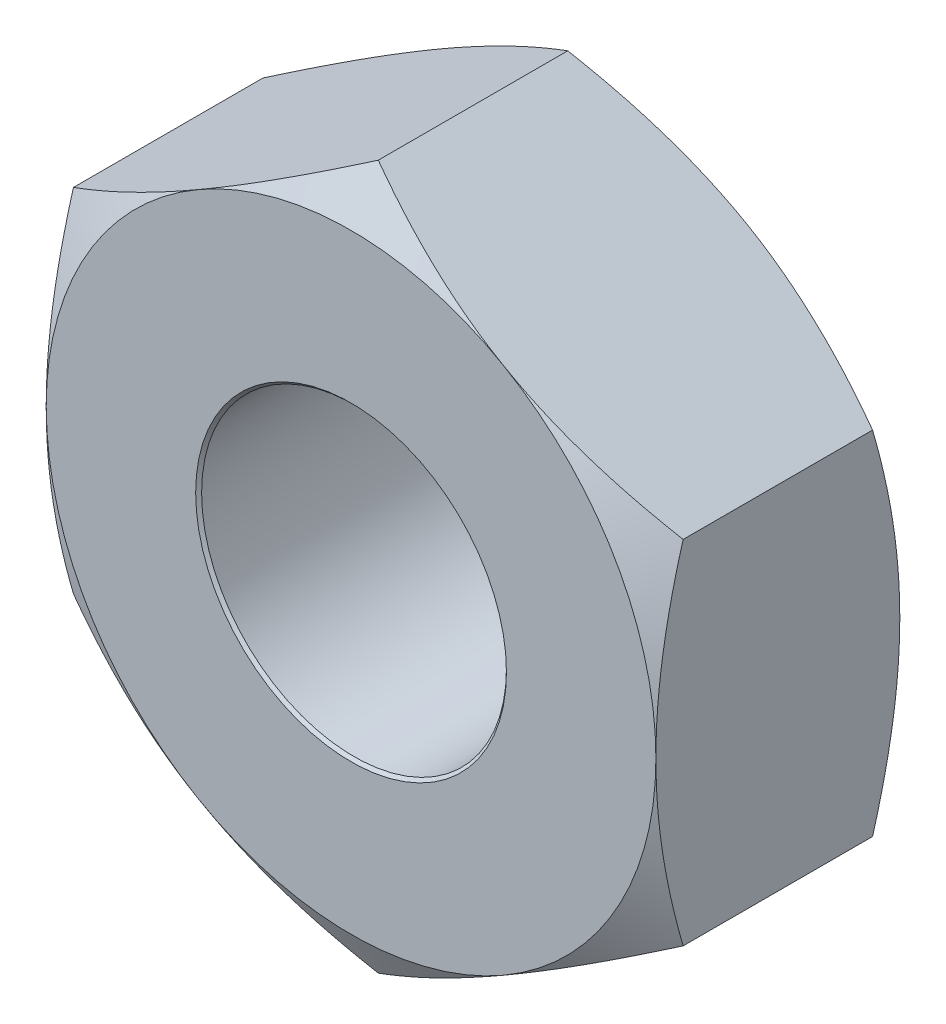
ISO-10303-21;
HEADER;
FILE_DESCRIPTION(('STEP AP214'),'2;1');
FILE_NAME('part.step','',(''),(''),'','','');
FILE_SCHEMA(('AUTOMOTIVE_DESIGN { 1 0 10303 214 1 1 1 1 }'));
ENDSEC;
DATA;
#1=APPLICATION_CONTEXT('core data for automotive mechanical design processes');
#2=APPLICATION_PROTOCOL_DEFINITION('international standard','automotive_design',2000,#1);
#3=PRODUCT_CONTEXT('',#1,'mechanical');
#4=PRODUCT('Part','Part','',(#3));
#5=PRODUCT_RELATED_PRODUCT_CATEGORY('part','',(#4));
#6=PRODUCT_DEFINITION_FORMATION('','',#4);
#7=PRODUCT_DEFINITION_CONTEXT('part definition',#1,'design');
#8=PRODUCT_DEFINITION('design','',#6,#7);
#9=PRODUCT_DEFINITION_SHAPE('','',#8);
#10=(LENGTH_UNIT() NAMED_UNIT(*) SI_UNIT(.MILLI.,.METRE.));
#11=(NAMED_UNIT(*) PLANE_ANGLE_UNIT() SI_UNIT($,.RADIAN.));
#12=(NAMED_UNIT(*) SI_UNIT($,.STERADIAN.) SOLID_ANGLE_UNIT());
#13=UNCERTAINTY_MEASURE_WITH_UNIT(LENGTH_MEASURE(1.E-05),#10,'distance_accuracy_value','');
#14=(GEOMETRIC_REPRESENTATION_CONTEXT(3) GLOBAL_UNCERTAINTY_ASSIGNED_CONTEXT((#13)) GLOBAL_UNIT_ASSIGNED_CONTEXT((#10,
#11,#12)) REPRESENTATION_CONTEXT('',''));
#15=CARTESIAN_POINT('',(0.,0.,0.));
#16=DIRECTION('',(0.,0.,1.));
#17=DIRECTION('',(1.,0.,0.));
#18=AXIS2_PLACEMENT_3D('',#15,#16,#17);
#19=CARTESIAN_POINT('',(0.,0.,-1.));
#20=DIRECTION('',(0.,0.,-1.));
#21=DIRECTION('',(-1.,0.,0.));
#22=AXIS2_PLACEMENT_3D('',#19,#20,#21);
#23=CONICAL_SURFACE('',#22,1.27435696448144,0.78539816339745);
#24=CARTESIAN_POINT('',(0.,0.,-0.975643035518566));
#25=DIRECTION('',(0.,0.,1.));
#26=DIRECTION('',(-1.,0.,0.));
#27=AXIS2_PLACEMENT_3D('',#24,#25,#26);
#28=CIRCLE('',#27,1.25);
#29=CARTESIAN_POINT('',(-1.25,0.,-0.975643035518566));
#30=VERTEX_POINT('',#29);
#31=EDGE_CURVE('E11',#30,#30,#28,.T.);
#32=ORIENTED_EDGE('',*,*,#31,.T.);
#33=EDGE_LOOP('',(#32));
#34=FACE_BOUND('',#33,.T.);
#35=CARTESIAN_POINT('',(0.,0.,-1.));
#36=DIRECTION('',(0.,0.,-1.));
#37=DIRECTION('',(-1.,0.,0.));
#38=AXIS2_PLACEMENT_3D('',#35,#36,#37);
#39=CIRCLE('',#38,1.27435696448144);
#40=CARTESIAN_POINT('',(-1.27435696448144,0.,-1.));
#41=VERTEX_POINT('',#40);
#42=EDGE_CURVE('E299',#41,#41,#39,.T.);
#43=ORIENTED_EDGE('',*,*,#42,.T.);
#44=EDGE_LOOP('',(#43));
#45=FACE_BOUND('',#44,.T.);
#46=ADVANCED_FACE('F16',(#34,#45),#23,.F.);
#47=CARTESIAN_POINT('',(0.,0.,1.));
#48=DIRECTION('',(0.,0.,1.));
#49=DIRECTION('',(1.,0.,0.));
#50=AXIS2_PLACEMENT_3D('',#47,#48,#49);
#51=CONICAL_SURFACE('',#50,1.27435696448144,0.78539816339745);
#52=CARTESIAN_POINT('',(0.,0.,0.975643035518566));
#53=DIRECTION('',(0.,0.,-1.));
#54=DIRECTION('',(1.,0.,0.));
#55=AXIS2_PLACEMENT_3D('',#52,#53,#54);
#56=CIRCLE('',#55,1.25);
#57=CARTESIAN_POINT('',(1.25,0.,0.975643035518566));
#58=VERTEX_POINT('',#57);
#59=EDGE_CURVE('E30',#58,#58,#56,.T.);
#60=ORIENTED_EDGE('',*,*,#59,.T.);
#61=EDGE_LOOP('',(#60));
#62=FACE_BOUND('',#61,.T.);
#63=CARTESIAN_POINT('',(0.,0.,1.));
#64=DIRECTION('',(0.,0.,1.));
#65=DIRECTION('',(1.,0.,0.));
#66=AXIS2_PLACEMENT_3D('',#63,#64,#65);
#67=CIRCLE('',#66,1.27435696448144);
#68=CARTESIAN_POINT('',(1.27435696448144,0.,1.));
#69=VERTEX_POINT('',#68);
#70=EDGE_CURVE('E999',#69,#69,#67,.T.);
#71=ORIENTED_EDGE('',*,*,#70,.T.);
#72=EDGE_LOOP('',(#71));
#73=FACE_BOUND('',#72,.T.);
#74=ADVANCED_FACE('F415',(#62,#73),#51,.F.);
#75=CARTESIAN_POINT('',(0.,0.,-1.));
#76=DIRECTION('',(0.,0.,1.));
#77=DIRECTION('',(1.,0.,0.));
#78=AXIS2_PLACEMENT_3D('',#75,#76,#77);
#79=CONICAL_SURFACE('',#78,2.5,1.0471975511966);
#80=CARTESIAN_POINT('',(0.,0.,-1.));
#81=DIRECTION('',(0.,0.,-1.));
#82=DIRECTION('',(1.,0.,0.));
#83=AXIS2_PLACEMENT_3D('',#80,#81,#82);
#84=CIRCLE('',#83,2.5);
#85=CARTESIAN_POINT('',(2.5,0.,-1.));
#86=VERTEX_POINT('',#85);
#87=CARTESIAN_POINT('',(1.25,-2.1650635094611,-1.));
#88=VERTEX_POINT('',#87);
#89=EDGE_CURVE('E530',#86,#88,#84,.T.);
#90=ORIENTED_EDGE('',*,*,#89,.F.);
#91=CARTESIAN_POINT('',(2.5,-1.44337567297418,-0.77670900630749));
#92=CARTESIAN_POINT('',(2.5,-1.06719090824318,-0.885304193898555));
#93=CARTESIAN_POINT('',(2.5,-0.727333879858001,-0.940155288511735));
#94=CARTESIAN_POINT('',(2.5,-0.356536433528046,-1.));
#95=CARTESIAN_POINT('',(2.5,0.,-1.));
#96=B_SPLINE_CURVE_WITH_KNOTS('',2,(#91,#92,#93,#94,#95),.UNSPECIFIED.,.F.,.F.,(3,2,3),(0.,0.5,
1.),.UNSPECIFIED.);
#97=CARTESIAN_POINT('',(2.5,-1.44337567297418,-0.77670900630749));
#98=VERTEX_POINT('',#97);
#99=EDGE_CURVE('E1068',#98,#86,#96,.T.);
#100=ORIENTED_EDGE('',*,*,#99,.F.);
#101=CARTESIAN_POINT('',(1.25,-2.16506350946109,-1.));
#102=CARTESIAN_POINT('',(1.55941196430674,-1.9864244285781,-1.));
#103=CARTESIAN_POINT('',(1.88220606748083,-1.80005916621771,-0.939723155230925));
#104=CARTESIAN_POINT('',(2.17495878359943,-1.63103830676065,-0.885056078442075));
#105=CARTESIAN_POINT('',(2.49999999999994,-1.44337567297409,-0.77670900630749));
#106=B_SPLINE_CURVE_WITH_KNOTS('',2,(#101,#102,#103,#104,#105),.UNSPECIFIED.,.F.,.F.,(3,2,3),
(0.,0.5,1.),.UNSPECIFIED.);
#107=EDGE_CURVE('E147',#88,#98,#106,.T.);
#108=ORIENTED_EDGE('',*,*,#107,.F.);
#109=EDGE_LOOP('',(#90,#100,#108));
#110=FACE_BOUND('',#109,.T.);
#111=ADVANCED_FACE('F568',(#110),#79,.T.);
#112=CARTESIAN_POINT('',(0.,0.,-1.));
#113=DIRECTION('',(0.,0.,1.));
#114=DIRECTION('',(1.,0.,0.));
#115=AXIS2_PLACEMENT_3D('',#112,#113,#114);
#116=CONICAL_SURFACE('',#115,2.5,1.0471975511966);
#117=CARTESIAN_POINT('',(0.,0.,-1.));
#118=DIRECTION('',(0.,0.,-1.));
#119=DIRECTION('',(1.,0.,0.));
#120=AXIS2_PLACEMENT_3D('',#117,#118,#119);
#121=CIRCLE('',#120,2.5);
#122=CARTESIAN_POINT('',(-1.25,-2.1650635094611,-1.));
#123=VERTEX_POINT('',#122);
#124=EDGE_CURVE('E141',#88,#123,#121,.T.);
#125=ORIENTED_EDGE('',*,*,#124,.F.);
#126=CARTESIAN_POINT('',(0.,-2.88675134594812,-0.77670900630741));
#127=CARTESIAN_POINT('',(0.669872981070598,-2.50000000000415,-1.));
#128=CARTESIAN_POINT('',(1.25,-2.16506350946109,-1.));
#129=B_SPLINE_CURVE_WITH_KNOTS('',2,(#126,#127,#128),.UNSPECIFIED.,.F.,.F.,(3,3),(0.,1.),.UNSPECIFIED.);
#130=CARTESIAN_POINT('',(0.,-2.88675134594812,-0.776709006307409));
#131=VERTEX_POINT('',#130);
#132=EDGE_CURVE('E133',#131,#88,#129,.T.);
#133=ORIENTED_EDGE('',*,*,#132,.F.);
#134=CARTESIAN_POINT('',(-1.24999999999999,-2.16506350946109,-1.));
#135=CARTESIAN_POINT('',(-0.940588035692977,-2.34370259034423,-1.));
#136=CARTESIAN_POINT('',(-0.617793932519125,-2.53006785270448,-0.93972315523092));
#137=CARTESIAN_POINT('',(-0.325041216399958,-2.69908871216188,-0.88505607844192));
#138=CARTESIAN_POINT('',(0.,-2.88675134594812,-0.77670900630741));
#139=B_SPLINE_CURVE_WITH_KNOTS('',2,(#134,#135,#136,#137,#138),.UNSPECIFIED.,.F.,.F.,(3,2,3),
(0.,0.5,1.),.UNSPECIFIED.);
#140=EDGE_CURVE('E137',#123,#131,#139,.T.);
#141=ORIENTED_EDGE('',*,*,#140,.F.);
#142=EDGE_LOOP('',(#125,#133,#141));
#143=FACE_BOUND('',#142,.T.);
#144=ADVANCED_FACE('F18',(#143),#116,.T.);
#145=CARTESIAN_POINT('',(0.,0.,-1.));
#146=DIRECTION('',(0.,0.,1.));
#147=DIRECTION('',(1.,0.,0.));
#148=AXIS2_PLACEMENT_3D('',#145,#146,#147);
#149=CONICAL_SURFACE('',#148,2.5,1.0471975511966);
#150=CARTESIAN_POINT('',(0.,0.,-1.));
#151=DIRECTION('',(0.,0.,-1.));
#152=DIRECTION('',(1.,0.,0.));
#153=AXIS2_PLACEMENT_3D('',#150,#151,#152);
#154=CIRCLE('',#153,2.5);
#155=CARTESIAN_POINT('',(-2.5,0.,-1.));
#156=VERTEX_POINT('',#155);
#157=EDGE_CURVE('E243',#123,#156,#154,.T.);
#158=ORIENTED_EDGE('',*,*,#157,.F.);
#159=CARTESIAN_POINT('',(-2.5,-1.44337567297405,-0.776709006307405));
#160=CARTESIAN_POINT('',(-1.8301270189294,-1.83012701891802,-1.));
#161=CARTESIAN_POINT('',(-1.24999999999999,-2.16506350946109,-1.));
#162=B_SPLINE_CURVE_WITH_KNOTS('',2,(#159,#160,#161),.UNSPECIFIED.,.F.,.F.,(3,3),(0.,1.),.UNSPECIFIED.);
#163=CARTESIAN_POINT('',(-2.5,-1.44337567297405,-0.776709006307406));
#164=VERTEX_POINT('',#163);
#165=EDGE_CURVE('E163',#164,#123,#162,.T.);
#166=ORIENTED_EDGE('',*,*,#165,.F.);
#167=CARTESIAN_POINT('',(-2.5,0.,-1.));
#168=CARTESIAN_POINT('',(-2.5,-0.356024272855809,-1.));
#169=CARTESIAN_POINT('',(-2.5,-0.727333879865234,-0.940155288510565));
#170=CARTESIAN_POINT('',(-2.5,-1.06659752609985,-0.88547548856871));
#171=CARTESIAN_POINT('',(-2.5,-1.44337567297405,-0.776709006307405));
#172=B_SPLINE_CURVE_WITH_KNOTS('',2,(#167,#168,#169,#170,#171),.UNSPECIFIED.,.F.,.F.,(3,2,3),
(0.,0.5,1.),.UNSPECIFIED.);
#173=EDGE_CURVE('E467',#156,#164,#172,.T.);
#174=ORIENTED_EDGE('',*,*,#173,.F.);
#175=EDGE_LOOP('',(#158,#166,#174));
#176=FACE_BOUND('',#175,.T.);
#177=ADVANCED_FACE('F211',(#176),#149,.T.);
#178=CARTESIAN_POINT('',(0.,0.,-1.));
#179=DIRECTION('',(0.,0.,1.));
#180=DIRECTION('',(1.,0.,0.));
#181=AXIS2_PLACEMENT_3D('',#178,#179,#180);
#182=CONICAL_SURFACE('',#181,2.5,1.0471975511966);
#183=CARTESIAN_POINT('',(0.,0.,-1.));
#184=DIRECTION('',(0.,0.,-1.));
#185=DIRECTION('',(1.,0.,0.));
#186=AXIS2_PLACEMENT_3D('',#183,#184,#185);
#187=CIRCLE('',#186,2.5);
#188=CARTESIAN_POINT('',(-1.25,2.1650635094611,-1.));
#189=VERTEX_POINT('',#188);
#190=EDGE_CURVE('E233',#156,#189,#187,.T.);
#191=ORIENTED_EDGE('',*,*,#190,.F.);
#192=CARTESIAN_POINT('',(-2.5,1.44337567297407,-0.7767090063074));
#193=CARTESIAN_POINT('',(-2.5,1.07011411791631,-0.884460335952765));
#194=CARTESIAN_POINT('',(-2.5,0.732711473700883,-0.939285017052365));
#195=CARTESIAN_POINT('',(-2.5,0.35905867027078,-1.));
#196=CARTESIAN_POINT('',(-2.5,0.,-1.));
#197=B_SPLINE_CURVE_WITH_KNOTS('',2,(#192,#193,#194,#195,#196),.UNSPECIFIED.,.F.,.F.,(3,2,3),
(0.,0.5,1.),.UNSPECIFIED.);
#198=CARTESIAN_POINT('',(-2.5,1.44337567297407,-0.776709006307401));
#199=VERTEX_POINT('',#198);
#200=EDGE_CURVE('E251',#199,#156,#197,.T.);
#201=ORIENTED_EDGE('',*,*,#200,.F.);
#202=CARTESIAN_POINT('',(-1.25,2.1650635094611,-1.));
#203=CARTESIAN_POINT('',(-1.55941196430711,1.9864244285779,-1.));
#204=CARTESIAN_POINT('',(-1.88220606748087,1.8000591662177,-0.93972315523091));
#205=CARTESIAN_POINT('',(-2.1749587836002,1.63103830676022,-0.88505607844186));
#206=CARTESIAN_POINT('',(-2.5,1.44337567297406,-0.7767090063074));
#207=B_SPLINE_CURVE_WITH_KNOTS('',2,(#202,#203,#204,#205,#206),.UNSPECIFIED.,.F.,.F.,(3,2,3),
(0.,0.5,1.),.UNSPECIFIED.);
#208=EDGE_CURVE('E346',#189,#199,#207,.T.);
#209=ORIENTED_EDGE('',*,*,#208,.F.);
#210=EDGE_LOOP('',(#191,#201,#209));
#211=FACE_BOUND('',#210,.T.);
#212=ADVANCED_FACE('F220',(#211),#182,.T.);
#213=CARTESIAN_POINT('',(0.,0.,-1.));
#214=DIRECTION('',(0.,0.,1.));
#215=DIRECTION('',(1.,0.,0.));
#216=AXIS2_PLACEMENT_3D('',#213,#214,#215);
#217=CONICAL_SURFACE('',#216,2.5,1.0471975511966);
#218=CARTESIAN_POINT('',(0.,0.,-1.));
#219=DIRECTION('',(0.,0.,-1.));
#220=DIRECTION('',(1.,0.,0.));
#221=AXIS2_PLACEMENT_3D('',#218,#219,#220);
#222=CIRCLE('',#221,2.5);
#223=CARTESIAN_POINT('',(1.25,2.1650635094611,-1.));
#224=VERTEX_POINT('',#223);
#225=EDGE_CURVE('E242',#189,#224,#222,.T.);
#226=ORIENTED_EDGE('',*,*,#225,.F.);
#227=CARTESIAN_POINT('',(0.,2.88675134594813,-0.776709006307405));
#228=CARTESIAN_POINT('',(-0.669872981070619,2.50000000000415,-1.));
#229=CARTESIAN_POINT('',(-1.25,2.1650635094611,-1.));
#230=B_SPLINE_CURVE_WITH_KNOTS('',2,(#227,#228,#229),.UNSPECIFIED.,.F.,.F.,(3,3),(0.,1.),.UNSPECIFIED.);
#231=CARTESIAN_POINT('',(0.,2.88675134594813,-0.776709006307403));
#232=VERTEX_POINT('',#231);
#233=EDGE_CURVE('E307',#232,#189,#230,.T.);
#234=ORIENTED_EDGE('',*,*,#233,.F.);
#235=CARTESIAN_POINT('',(1.25000000000001,2.1650635094611,-1.));
#236=CARTESIAN_POINT('',(0.94058803569276,2.34370259034438,-1.));
#237=CARTESIAN_POINT('',(0.617793932519138,2.53006785270449,-0.939723155230916));
#238=CARTESIAN_POINT('',(0.325041216399677,2.69908871216206,-0.885056078441816));
#239=CARTESIAN_POINT('',(0.,2.88675134594813,-0.776709006307406));
#240=B_SPLINE_CURVE_WITH_KNOTS('',2,(#235,#236,#237,#238,#239),.UNSPECIFIED.,.F.,.F.,(3,2,3),
(0.,0.5,1.),.UNSPECIFIED.);
#241=EDGE_CURVE('E380',#224,#232,#240,.T.);
#242=ORIENTED_EDGE('',*,*,#241,.F.);
#243=EDGE_LOOP('',(#226,#234,#242));
#244=FACE_BOUND('',#243,.T.);
#245=ADVANCED_FACE('F278',(#244),#217,.T.);
#246=CARTESIAN_POINT('',(0.,0.,-1.));
#247=DIRECTION('',(0.,0.,1.));
#248=DIRECTION('',(1.,0.,0.));
#249=AXIS2_PLACEMENT_3D('',#246,#247,#248);
#250=CONICAL_SURFACE('',#249,2.5,1.0471975511966);
#251=CARTESIAN_POINT('',(2.5,0.,-1.));
#252=CARTESIAN_POINT('',(2.5,0.358546870905485,-1.));
#253=CARTESIAN_POINT('',(2.5,0.7327114736965,-0.939285017053085));
#254=CARTESIAN_POINT('',(2.5,1.06952086217606,-0.88463159413344));
#255=CARTESIAN_POINT('',(2.5,1.44337567297407,-0.776709006307405));
#256=B_SPLINE_CURVE_WITH_KNOTS('',2,(#251,#252,#253,#254,#255),.UNSPECIFIED.,.F.,.F.,(3,2,3),
(0.,0.5,1.),.UNSPECIFIED.);
#257=CARTESIAN_POINT('',(2.5,1.44337567297407,-0.776709006307406));
#258=VERTEX_POINT('',#257);
#259=EDGE_CURVE('E1061',#86,#258,#256,.T.);
#260=ORIENTED_EDGE('',*,*,#259,.F.);
#261=CARTESIAN_POINT('',(0.,0.,-1.));
#262=DIRECTION('',(0.,0.,1.));
#263=DIRECTION('',(1.,0.,0.));
#264=AXIS2_PLACEMENT_3D('',#261,#262,#263);
#265=CIRCLE('',#264,2.5);
#266=EDGE_CURVE('E1153',#86,#224,#265,.T.);
#267=ORIENTED_EDGE('',*,*,#266,.T.);
#268=CARTESIAN_POINT('',(2.5,1.44337567297407,-0.776709006307406));
#269=CARTESIAN_POINT('',(1.83012701892939,1.83012701891804,-1.));
#270=CARTESIAN_POINT('',(1.25000000000001,2.1650635094611,-1.));
#271=B_SPLINE_CURVE_WITH_KNOTS('',2,(#268,#269,#270),.UNSPECIFIED.,.F.,.F.,(3,3),(0.,1.),.UNSPECIFIED.);
#272=EDGE_CURVE('E386',#258,#224,#271,.T.);
#273=ORIENTED_EDGE('',*,*,#272,.F.);
#274=EDGE_LOOP('',(#260,#267,#273));
#275=FACE_BOUND('',#274,.T.);
#276=ADVANCED_FACE('F221',(#275),#250,.T.);
#277=CARTESIAN_POINT('',(0.,0.,1.));
#278=DIRECTION('',(0.,0.,-1.));
#279=DIRECTION('',(1.,0.,0.));
#280=AXIS2_PLACEMENT_3D('',#277,#278,#279);
#281=CONICAL_SURFACE('',#280,2.5,1.0471975511966);
#282=CARTESIAN_POINT('',(1.25,2.16506350946109,1.));
#283=CARTESIAN_POINT('',(1.1973376519546,2.19544629836629,1.00002122820986));
#284=CARTESIAN_POINT('',(1.14465957489277,2.22580101022077,0.998760283259273));
#285=CARTESIAN_POINT('',(1.03962673820466,2.28633569969667,0.993716017519844));
#286=CARTESIAN_POINT('',(0.987271564280388,2.31651586612056,0.989943604101614));
#287=CARTESIAN_POINT('',(0.882393725295349,2.37706942325835,0.979880656964627));
#288=CARTESIAN_POINT('',(0.829872714735595,2.40744257989733,0.973571586833744));
#289=CARTESIAN_POINT('',(0.724117736178538,2.46861013052463,0.958478691993865));
#290=CARTESIAN_POINT('',(0.670888544003406,2.49940192777648,0.949651261429461));
#291=CARTESIAN_POINT('',(0.567070334904166,2.55936434801829,0.930238402450601));
#292=CARTESIAN_POINT('',(0.516469566583389,2.58854596200256,0.919749083484684));
#293=CARTESIAN_POINT('',(0.41486174160398,2.64716833841249,0.896710117301689));
#294=CARTESIAN_POINT('',(0.363859612984646,2.6766066232036,0.884132504815016));
#295=CARTESIAN_POINT('',(0.261157143495956,2.73590825033239,0.856935985883545));
#296=CARTESIAN_POINT('',(0.209464418694783,2.76576765649997,0.842279984085456));
#297=CARTESIAN_POINT('',(0.105111835169821,2.8260457425153,0.810931835399662));
#298=CARTESIAN_POINT('',(0.0524616270728385,2.85645886405582,0.794196766289006));
#299=CARTESIAN_POINT('',(0.,2.88675134594812,0.776709006307402));
#300=B_SPLINE_CURVE_WITH_KNOTS('',3,(#282,#283,#284,#285,#286,#287,#288,#289,#290,#291,#292,
#293,#294,#295,#296,#297,#298,#299),.UNSPECIFIED.,.F.,.F.,(4,2,2,2,2,2,2,2,4),(0.,
0.182380465673236,0.363973971080128,0.546919300279387,0.73324766315141,0.911255273309138,
1.09187401631464,1.27625891558621,1.46542190491653),.UNSPECIFIED.);
#301=CARTESIAN_POINT('',(1.25,2.1650635094611,1.));
#302=VERTEX_POINT('',#301);
#303=CARTESIAN_POINT('',(0.,2.88675134594813,0.776709006307403));
#304=VERTEX_POINT('',#303);
#305=EDGE_CURVE('E361',#302,#304,#300,.T.);
#306=ORIENTED_EDGE('',*,*,#305,.T.);
#307=CARTESIAN_POINT('',(0.,2.88675134594812,0.776709006307402));
#308=CARTESIAN_POINT('',(-0.0524740065390064,2.85645134053524,0.794201244934283));
#309=CARTESIAN_POINT('',(-0.105142679085746,2.82603845794373,0.810935656931974));
#310=CARTESIAN_POINT('',(-0.209573059580187,2.76574880591582,0.842286699748274));
#311=CARTESIAN_POINT('',(-0.261325210029163,2.73587725039229,0.856945297800471));
#312=CARTESIAN_POINT('',(-0.364182073073287,2.67653197614907,0.884151280120466));
#313=CARTESIAN_POINT('',(-0.415279395484295,2.64706204661166,0.896734632676111));
#314=CARTESIAN_POINT('',(-0.517108668131017,2.58835112379386,0.919788819933049));
#315=CARTESIAN_POINT('',(-0.567835962023478,2.55911256527261,0.930286356016276));
#316=CARTESIAN_POINT('',(-0.671785938266525,2.49908335642767,0.949694731592277));
#317=CARTESIAN_POINT('',(-0.725019304628973,2.46828148986288,0.9585142902416));
#318=CARTESIAN_POINT('',(-0.830725782142667,2.40710866758423,0.973592651079762));
#319=CARTESIAN_POINT('',(-0.883194051830785,2.376740684492,0.979897045219432));
#320=CARTESIAN_POINT('',(-0.987916225456374,2.31622505838499,0.98995064799648));
#321=CARTESIAN_POINT('',(-1.04016827084862,2.28607768865202,0.993720716853189));
#322=CARTESIAN_POINT('',(-1.14494978577106,2.22564737040332,0.998760212757112));
#323=CARTESIAN_POINT('',(-1.19747959649394,2.19536430764369,1.00002115953468));
#324=CARTESIAN_POINT('',(-1.25,2.16506350946109,1.));
#325=B_SPLINE_CURVE_WITH_KNOTS('',3,(#307,#308,#309,#310,#311,#312,#313,#314,#315,#316,#317,
#318,#319,#320,#321,#322,#323,#324),.UNSPECIFIED.,.F.,.F.,(4,2,2,2,2,2,2,2,4),(0.,
0.189208252890503,0.373762448535054,0.554672953225491,0.733092527500666,0.919443639311701,
1.10224390970384,1.28352048549225,1.46540870180805),.UNSPECIFIED.);
#326=CARTESIAN_POINT('',(-1.25,2.1650635094611,1.));
#327=VERTEX_POINT('',#326);
#328=EDGE_CURVE('E481',#304,#327,#325,.T.);
#329=ORIENTED_EDGE('',*,*,#328,.T.);
#330=CARTESIAN_POINT('',(0.,0.,1.));
#331=DIRECTION('',(0.,0.,1.));
#332=DIRECTION('',(1.,0.,0.));
#333=AXIS2_PLACEMENT_3D('',#330,#331,#332);
#334=CIRCLE('',#333,2.5);
#335=EDGE_CURVE('E390',#302,#327,#334,.T.);
#336=ORIENTED_EDGE('',*,*,#335,.F.);
#337=EDGE_LOOP('',(#306,#329,#336));
#338=FACE_BOUND('',#337,.T.);
#339=ADVANCED_FACE('F414',(#338),#281,.T.);
#340=CARTESIAN_POINT('',(0.,0.,1.));
#341=DIRECTION('',(0.,0.,-1.));
#342=DIRECTION('',(1.,0.,0.));
#343=AXIS2_PLACEMENT_3D('',#340,#341,#342);
#344=CONICAL_SURFACE('',#343,2.5,1.0471975511966);
#345=CARTESIAN_POINT('',(-1.25,2.16506350946109,1.));
#346=CARTESIAN_POINT('',(-1.30264344105243,2.13464797268344,1.00002122820986));
#347=CARTESIAN_POINT('',(-1.35527043117388,2.10420477565262,0.998760283259272));
#348=CARTESIAN_POINT('',(-1.46021142841426,2.04351101558712,0.993716017519842));
#349=CARTESIAN_POINT('',(-1.51252580618992,2.0132601881611,0.989943604101613));
#350=CARTESIAN_POINT('',(-1.61740564445328,1.95271009387494,0.979880656964625));
#351=CARTESIAN_POINT('',(-1.66997007497564,1.92241214281725,0.973571586833743));
#352=CARTESIAN_POINT('',(-1.77582021698467,1.86140942012382,0.958478691993864));
#353=CARTESIAN_POINT('',(-1.82910129172052,1.83070748610316,0.94965126142946));
#354=CARTESIAN_POINT('',(-1.93293937547194,1.77077948976872,0.930238402450599));
#355=CARTESIAN_POINT('',(-1.98351177866614,1.74154874594404,0.919749083484683));
#356=CARTESIAN_POINT('',(-2.08508415835706,1.68286497649355,0.896710117301688));
#357=CARTESIAN_POINT('',(-2.13607952513968,1.65341497985769,0.884132504815015));
#358=CARTESIAN_POINT('',(-2.23878747546331,1.59412284581348,0.856935985883544));
#359=CARTESIAN_POINT('',(-2.29049284214694,1.56428533602861,0.842279984085455));
#360=CARTESIAN_POINT('',(-2.3948714876902,1.50405239075312,0.810931835399661));
#361=CARTESIAN_POINT('',(-2.44753512760117,1.47366253379685,0.794196766289004));
#362=CARTESIAN_POINT('',(-2.5,1.44337567297406,0.7767090063074));
#363=B_SPLINE_CURVE_WITH_KNOTS('',3,(#345,#346,#347,#348,#349,#350,#351,#352,#353,#354,#355,
#356,#357,#358,#359,#360,#361,#362),.UNSPECIFIED.,.F.,.F.,(4,2,2,2,2,2,2,2,4),(0.,
0.182380465673237,0.363973971080122,0.546919300279374,0.733247663151386,0.911255273309122,
1.09187401631462,1.2762589155862,1.46542190491653),.UNSPECIFIED.);
#364=CARTESIAN_POINT('',(-2.5,1.44337567297407,0.776709006307401));
#365=VERTEX_POINT('',#364);
#366=EDGE_CURVE('E355',#327,#365,#363,.T.);
#367=ORIENTED_EDGE('',*,*,#366,.T.);
#368=CARTESIAN_POINT('',(-2.5,1.44337567297406,0.7767090063074));
#369=CARTESIAN_POINT('',(-2.49999682043226,1.38303545076496,0.79412773771344));
#370=CARTESIAN_POINT('',(-2.49998422499075,1.32247331493865,0.810799332528267));
#371=CARTESIAN_POINT('',(-2.49996009175674,1.20243091303236,0.842038859279068));
#372=CARTESIAN_POINT('',(-2.49994853535768,1.1429616229833,0.85664907448539));
#373=CARTESIAN_POINT('',(-2.49994432521447,1.02481411404017,0.883772188901467));
#374=CARTESIAN_POINT('',(-2.4999512925156,0.96614434249316,0.896321642338811));
#375=CARTESIAN_POINT('',(-2.49998500652751,0.849270922484594,0.919322687142544));
#376=CARTESIAN_POINT('',(-2.5000114671263,0.791072718049426,0.929801871887944));
#377=CARTESIAN_POINT('',(-2.49998790854332,0.671172737743935,0.949284474274859));
#378=CARTESIAN_POINT('',(-2.49993364696528,0.609452725084597,0.958176480156435));
#379=CARTESIAN_POINT('',(-2.49983594690303,0.486834497489433,0.973379413626212));
#380=CARTESIAN_POINT('',(-2.49979232925991,0.425941794502795,0.979734410285243));
#381=CARTESIAN_POINT('',(-2.49979158386649,0.304393625108032,0.989870566403404));
#382=CARTESIAN_POINT('',(-2.49983382034947,0.243739723199007,0.99367037023749));
#383=CARTESIAN_POINT('',(-2.49992839859308,0.122057661843643,0.998751480161028));
#384=CARTESIAN_POINT('',(-2.49998078426612,0.0610290343432118,1.00002156131103));
#385=CARTESIAN_POINT('',(-2.5,0.,1.));
#386=B_SPLINE_CURVE_WITH_KNOTS('',3,(#368,#369,#370,#371,#372,#373,#374,#375,#376,#377,#378,
#379,#380,#381,#382,#383,#384,#385),.UNSPECIFIED.,.F.,.F.,(4,2,2,2,2,2,2,2,4),(0.,
0.18841621980591,0.372105482198233,0.552065921386627,0.729436337586419,0.916463727610989,
1.10008400151127,1.2823494852276,1.4654219353799),.UNSPECIFIED.);
#387=CARTESIAN_POINT('',(-2.5,0.,1.));
#388=VERTEX_POINT('',#387);
#389=EDGE_CURVE('E428',#365,#388,#386,.T.);
#390=ORIENTED_EDGE('',*,*,#389,.T.);
#391=CARTESIAN_POINT('',(0.,0.,1.));
#392=DIRECTION('',(0.,0.,1.));
#393=DIRECTION('',(1.,0.,0.));
#394=AXIS2_PLACEMENT_3D('',#391,#392,#393);
#395=CIRCLE('',#394,2.5);
#396=EDGE_CURVE('E394',#327,#388,#395,.T.);
#397=ORIENTED_EDGE('',*,*,#396,.F.);
#398=EDGE_LOOP('',(#367,#390,#397));
#399=FACE_BOUND('',#398,.T.);
#400=ADVANCED_FACE('F405',(#399),#344,.T.);
#401=CARTESIAN_POINT('',(0.,0.,1.));
#402=DIRECTION('',(0.,0.,-1.));
#403=DIRECTION('',(1.,0.,0.));
#404=AXIS2_PLACEMENT_3D('',#401,#402,#403);
#405=CONICAL_SURFACE('',#404,2.5,1.0471975511966);
#406=CARTESIAN_POINT('',(-2.5,0.,1.));
#407=CARTESIAN_POINT('',(-2.49998135569771,-0.0605761311068298,1.00002092814138));
#408=CARTESIAN_POINT('',(-2.49993096724558,-0.121151852003608,0.998769065354586));
#409=CARTESIAN_POINT('',(-2.49984037361312,-0.241939542385222,0.993761110070162));
#410=CARTESIAN_POINT('',(-2.49980012567699,-0.302151957571261,0.990015782962914));
#411=CARTESIAN_POINT('',(-2.49980207533167,-0.422815671217613,0.980025091130783));
#412=CARTESIAN_POINT('',(-2.49984488423313,-0.483265447951726,0.973761460373292));
#413=CARTESIAN_POINT('',(-2.49993879686461,-0.604984240097238,0.958776899751991));
#414=CARTESIAN_POINT('',(-2.49999003848693,-0.666247913555163,0.950012955447585));
#415=CARTESIAN_POINT('',(-2.50000958789076,-0.786128720382922,0.930667348964893));
#416=CARTESIAN_POINT('',(-2.49998093415334,-0.844758934139704,0.920166191793985));
#417=CARTESIAN_POINT('',(-2.4999450031101,-0.962501444754832,0.897087433112889));
#418=CARTESIAN_POINT('',(-2.49993804548979,-1.02160820011201,0.88448163594002));
#419=CARTESIAN_POINT('',(-2.49994356654125,-1.14064392014,0.857212793567388));
#420=CARTESIAN_POINT('',(-2.49995645465038,-1.2005642355437,0.842512244284093));
#421=CARTESIAN_POINT('',(-2.49998302783156,-1.32153089121352,0.811059194872843));
#422=CARTESIAN_POINT('',(-2.49999672491454,-1.38256596642504,0.794263258597136));
#423=CARTESIAN_POINT('',(-2.5,-1.44337567297405,0.776709006307404));
#424=B_SPLINE_CURVE_WITH_KNOTS('',3,(#406,#407,#408,#409,#410,#411,#412,#413,#414,#415,#416,
#417,#418,#419,#420,#421,#422,#423),.UNSPECIFIED.,.F.,.F.,(4,2,2,2,2,2,2,2,4),(0.,
0.181714045001483,0.36264859415389,0.544919901386001,0.730538514578433,0.909195208071148,
1.09047220592724,1.27553954421282,1.46542193955232),.UNSPECIFIED.);
#425=CARTESIAN_POINT('',(-2.5,-1.44337567297405,0.776709006307406));
#426=VERTEX_POINT('',#425);
#427=EDGE_CURVE('E448',#388,#426,#424,.T.);
#428=ORIENTED_EDGE('',*,*,#427,.T.);
#429=CARTESIAN_POINT('',(-2.5,-1.44337567297405,0.776709006307404));
#430=CARTESIAN_POINT('',(-2.44752242230769,-1.47366949296898,0.794201244934431));
#431=CARTESIAN_POINT('',(-2.39484975710731,-1.50407546008252,0.810935656932277));
#432=CARTESIAN_POINT('',(-2.29042219661797,-1.56436999650386,0.842286699748776));
#433=CARTESIAN_POINT('',(-2.23867659545939,-1.59425289573139,0.856945297801027));
#434=CARTESIAN_POINT('',(-2.13585364884812,-1.65365691495947,0.88415128012103));
#435=CARTESIAN_POINT('',(-2.08478328001562,-1.68317352946395,0.896734632676637));
#436=CARTESIAN_POINT('',(-1.98302349305303,-1.74200480501577,0.919788819933365));
#437=CARTESIAN_POINT('',(-1.93233851165782,-1.77131665093113,0.93028635601643));
#438=CARTESIAN_POINT('',(-1.82837670370762,-1.83132536665816,0.949694731592288));
#439=CARTESIAN_POINT('',(-1.77508482159695,-1.86202588097497,0.958514290241594));
#440=CARTESIAN_POINT('',(-1.66925436472509,-1.92298396470749,0.973592651079741));
#441=CARTESIAN_POINT('',(-1.6167207850613,-1.95323882760394,0.979897045219422));
#442=CARTESIAN_POINT('',(-1.51195162871387,-2.01367307724963,0.989950647996474));
#443=CARTESIAN_POINT('',(-1.45971721797183,-2.0438509910924,0.993720716853189));
#444=CARTESIAN_POINT('',(-1.35499226974896,-2.10437928573747,0.99876021275711));
#445=CARTESIAN_POINT('',(-1.30250146273368,-2.13472990489937,1.00002115953469));
#446=CARTESIAN_POINT('',(-1.24999999999999,-2.16506350946109,1.00000000000001));
#447=B_SPLINE_CURVE_WITH_KNOTS('',3,(#429,#430,#431,#432,#433,#434,#435,#436,#437,#438,#439,
#440,#441,#442,#443,#444,#445,#446),.UNSPECIFIED.,.F.,.F.,(4,2,2,2,2,2,2,2,4),(0.,
0.189208252892075,0.373762448537097,0.554672953226987,0.733092527500691,0.919443639313174,
1.1022439097058,1.28352048549372,1.46540870180806),.UNSPECIFIED.);
#448=CARTESIAN_POINT('',(-1.25,-2.16506350946109,1.));
#449=VERTEX_POINT('',#448);
#450=EDGE_CURVE('E123',#426,#449,#447,.T.);
#451=ORIENTED_EDGE('',*,*,#450,.T.);
#452=CARTESIAN_POINT('',(0.,0.,1.));
#453=DIRECTION('',(0.,0.,1.));
#454=DIRECTION('',(1.,0.,0.));
#455=AXIS2_PLACEMENT_3D('',#452,#453,#454);
#456=CIRCLE('',#455,2.5);
#457=EDGE_CURVE('E442',#388,#449,#456,.T.);
#458=ORIENTED_EDGE('',*,*,#457,.F.);
#459=EDGE_LOOP('',(#428,#451,#458));
#460=FACE_BOUND('',#459,.T.);
#461=ADVANCED_FACE('F281',(#460),#405,.T.);
#462=CARTESIAN_POINT('',(0.,0.,1.));
#463=DIRECTION('',(0.,0.,-1.));
#464=DIRECTION('',(1.,0.,0.));
#465=AXIS2_PLACEMENT_3D('',#462,#463,#464);
#466=CONICAL_SURFACE('',#465,2.5,1.0471975511966);
#467=CARTESIAN_POINT('',(-1.24999999999999,-2.16506350946109,1.00000000000001));
#468=CARTESIAN_POINT('',(-1.19733765195423,-2.19544629836649,1.00002122820986));
#469=CARTESIAN_POINT('',(-1.14465957489201,-2.22580101022115,0.998760283259284));
#470=CARTESIAN_POINT('',(-1.03962673820338,-2.28633569969724,0.993716017519853));
#471=CARTESIAN_POINT('',(-0.987271564278958,-2.31651586612114,0.989943604101628));
#472=CARTESIAN_POINT('',(-0.882393725293875,-2.37706942325886,0.979880656964644));
#473=CARTESIAN_POINT('',(-0.829872714734227,-2.40744257989775,0.973571586833772));
#474=CARTESIAN_POINT('',(-0.724117736177699,-2.46861013052484,0.95847869199388));
#475=CARTESIAN_POINT('',(-0.670888544002991,-2.49940192777658,0.949651261429463));
#476=CARTESIAN_POINT('',(-0.567070334903878,-2.55936434801857,0.93023840245048));
#477=CARTESIAN_POINT('',(-0.516469566582807,-2.58854596200313,0.919749083484427));
#478=CARTESIAN_POINT('',(-0.414861741602962,-2.64716833841341,0.896710117301252));
#479=CARTESIAN_POINT('',(-0.363859612983482,-2.67660662320458,0.884132504814548));
#480=CARTESIAN_POINT('',(-0.261157143494728,-2.73590825033331,0.856935985883082));
#481=CARTESIAN_POINT('',(-0.209464418693635,-2.76576765650078,0.842279984085039));
#482=CARTESIAN_POINT('',(-0.105111835169102,-2.82604574251575,0.810931835399414));
#483=CARTESIAN_POINT('',(-0.0524616270724674,-2.85645886405603,0.794196766288889));
#484=CARTESIAN_POINT('',(0.,-2.88675134594811,0.776709006307408));
#485=B_SPLINE_CURVE_WITH_KNOTS('',3,(#467,#468,#469,#470,#471,#472,#473,#474,#475,#476,#477,
#478,#479,#480,#481,#482,#483,#484),.UNSPECIFIED.,.F.,.F.,(4,2,2,2,2,2,2,2,4),(0.,
0.182380465674487,0.363973971081793,0.546919300280633,0.733247663151408,0.911255273310393,
1.09187401631636,1.27625891558754,1.46542190491653),.UNSPECIFIED.);
#486=CARTESIAN_POINT('',(0.,-2.88675134594812,0.776709006307409));
#487=VERTEX_POINT('',#486);
#488=EDGE_CURVE('E159',#449,#487,#485,.T.);
#489=ORIENTED_EDGE('',*,*,#488,.T.);
#490=CARTESIAN_POINT('',(0.,-2.88675134594811,0.776709006307408));
#491=CARTESIAN_POINT('',(0.0524740065397983,-2.85645134053476,0.794201244934553));
#492=CARTESIAN_POINT('',(0.105142679087284,-2.82603845794273,0.810935656932525));
#493=CARTESIAN_POINT('',(0.209573059582646,-2.76574880591405,0.842286699749187));
#494=CARTESIAN_POINT('',(0.261325210031793,-2.73587725039028,0.856945297801483));
#495=CARTESIAN_POINT('',(0.364182073075782,-2.67653197614693,0.88415128012149));
#496=CARTESIAN_POINT('',(0.415279395486479,-2.64706204660964,0.896734632677066));
#497=CARTESIAN_POINT('',(0.517108668132272,-2.58835112379259,0.91978881993362));
#498=CARTESIAN_POINT('',(0.567835962024108,-2.55911256527196,0.930286356016553));
#499=CARTESIAN_POINT('',(0.671785938267422,-2.49908335642742,0.949694731592292));
#500=CARTESIAN_POINT('',(0.725019304630767,-2.4682814898624,0.958514290241585));
#501=CARTESIAN_POINT('',(0.830725782145579,-2.40710866758332,0.973592651079719));
#502=CARTESIAN_POINT('',(0.88319405183392,-2.37674068449088,0.97989704521941));
#503=CARTESIAN_POINT('',(0.987916225459413,-2.31622505838371,0.989950647996464));
#504=CARTESIAN_POINT('',(1.04016827085134,-2.28607768865079,0.993720716853184));
#505=CARTESIAN_POINT('',(1.14494978577264,-2.2256473704025,0.998760212757103));
#506=CARTESIAN_POINT('',(1.19747959649471,-2.19536430764324,1.00002115953469));
#507=CARTESIAN_POINT('',(1.25,-2.16506350946109,1.00000000000001));
#508=B_SPLINE_CURVE_WITH_KNOTS('',3,(#490,#491,#492,#493,#494,#495,#496,#497,#498,#499,#500,
#501,#502,#503,#504,#505,#506,#507),.UNSPECIFIED.,.F.,.F.,(4,2,2,2,2,2,2,2,4),(0.,
0.189208252893356,0.373762448538758,0.554672953228194,0.733092527500685,0.919443639314364,
1.10224390970739,1.2835204854949,1.46540870180803),.UNSPECIFIED.);
#509=CARTESIAN_POINT('',(1.25,-2.16506350946109,1.));
#510=VERTEX_POINT('',#509);
#511=EDGE_CURVE('E155',#487,#510,#508,.T.);
#512=ORIENTED_EDGE('',*,*,#511,.T.);
#513=CARTESIAN_POINT('',(0.,0.,1.));
#514=DIRECTION('',(0.,0.,1.));
#515=DIRECTION('',(1.,0.,0.));
#516=AXIS2_PLACEMENT_3D('',#513,#514,#515);
#517=CIRCLE('',#516,2.5);
#518=EDGE_CURVE('E995',#449,#510,#517,.T.);
#519=ORIENTED_EDGE('',*,*,#518,.F.);
#520=EDGE_LOOP('',(#489,#512,#519));
#521=FACE_BOUND('',#520,.T.);
#522=ADVANCED_FACE('F625',(#521),#466,.T.);
#523=CARTESIAN_POINT('',(0.,0.,1.));
#524=DIRECTION('',(0.,0.,-1.));
#525=DIRECTION('',(1.,0.,0.));
#526=AXIS2_PLACEMENT_3D('',#523,#524,#525);
#527=CONICAL_SURFACE('',#526,2.5,1.0471975511966);
#528=CARTESIAN_POINT('',(1.25,-2.16506350946109,1.00000000000001));
#529=CARTESIAN_POINT('',(1.30264344105336,-2.13464797268288,1.00002122820986));
#530=CARTESIAN_POINT('',(1.35527043117572,-2.10420477565142,0.998760283259295));
#531=CARTESIAN_POINT('',(1.46021142841723,-2.04351101558497,0.993716017519861));
#532=CARTESIAN_POINT('',(1.51252580619313,-2.01326018815863,0.989943604101645));
#533=CARTESIAN_POINT('',(1.61740564445637,-1.95271009387227,0.979880656964668));
#534=CARTESIAN_POINT('',(1.66997007497838,-1.9224121428147,0.973571586833812));
#535=CARTESIAN_POINT('',(1.77582021698625,-1.86140942012219,0.9584786919939));
#536=CARTESIAN_POINT('',(1.82910129172129,-1.83070748610235,0.949651261429462));
#537=CARTESIAN_POINT('',(1.93293937547298,-1.77077948976844,0.930238402450278));
#538=CARTESIAN_POINT('',(1.98351177866824,-1.74154874594348,0.919749083483997));
#539=CARTESIAN_POINT('',(2.08508415836054,-1.68286497649245,0.896710117300526));
#540=CARTESIAN_POINT('',(2.13607952514347,-1.65341497985633,0.884132504813768));
#541=CARTESIAN_POINT('',(2.23878747546704,-1.59412284581191,0.856935985882309));
#542=CARTESIAN_POINT('',(2.29049284215031,-1.56428533602709,0.842279984084341));
#543=CARTESIAN_POINT('',(2.39487148769216,-1.50405239075214,0.810931835398991));
#544=CARTESIAN_POINT('',(2.4475351276021,-1.47366253379637,0.794196766288681));
#545=CARTESIAN_POINT('',(2.49999999999994,-1.44337567297415,0.776709006307402));
#546=B_SPLINE_CURVE_WITH_KNOTS('',3,(#528,#529,#530,#531,#532,#533,#534,#535,#536,#537,#538,
#539,#540,#541,#542,#543,#544,#545),.UNSPECIFIED.,.F.,.F.,(4,2,2,2,2,2,2,2,4),(0.,
0.18238046567652,0.363973971084495,0.546919300282646,0.733247663151387,0.91125527331246,
1.0918740163192,1.2762589155897,1.46542190491645),.UNSPECIFIED.);
#547=CARTESIAN_POINT('',(2.5,-1.44337567297418,0.77670900630749));
#548=VERTEX_POINT('',#547);
#549=EDGE_CURVE('E928',#510,#548,#546,.T.);
#550=ORIENTED_EDGE('',*,*,#549,.T.);
#551=CARTESIAN_POINT('',(2.49999999999994,-1.44337567297415,0.776709006307402));
#552=CARTESIAN_POINT('',(2.49999676101082,-1.38257232554036,0.7942614145315));
#553=CARTESIAN_POINT('',(2.49998364039227,-1.3215435877334,0.811055396208141));
#554=CARTESIAN_POINT('',(2.4999584970891,-1.20058517213183,0.842505928457731));
#555=CARTESIAN_POINT('',(2.4999464550306,-1.14066672688201,0.857205790105344));
#556=CARTESIAN_POINT('',(2.49994217242234,-1.02163063801063,0.88447455256937));
#557=CARTESIAN_POINT('',(2.4999495327075,-0.962521612919542,0.897080825388679));
#558=CARTESIAN_POINT('',(2.49998420744315,-0.844770901817969,0.920162255404776));
#559=CARTESIAN_POINT('',(2.50001123323883,-0.786134730031573,0.930665468093065));
#560=CARTESIAN_POINT('',(2.49998833140157,-0.666254122153051,0.950012899925937));
#561=CARTESIAN_POINT('',(2.49993538073878,-0.604996674031571,0.958777046085929));
#562=CARTESIAN_POINT('',(2.49984021900677,-0.483286164477837,0.973761801993182));
#563=CARTESIAN_POINT('',(2.49979783205431,-0.422838428203714,0.980025286852979));
#564=CARTESIAN_POINT('',(2.49979717564796,-0.302174698649949,0.990015927308548));
#565=CARTESIAN_POINT('',(2.49983829720503,-0.241960213074552,0.993761182045703));
#566=CARTESIAN_POINT('',(2.49993034606982,-0.121164251423019,0.998769164061856));
#567=CARTESIAN_POINT('',(2.49998131550574,-0.0605823225626671,1.00002095456649));
#568=CARTESIAN_POINT('',(2.49999999999999,0.,1.00000000000001));
#569=B_SPLINE_CURVE_WITH_KNOTS('',3,(#551,#552,#553,#554,#555,#556,#557,#558,#559,#560,#561,
#562,#563,#564,#565,#566,#567,#568),.UNSPECIFIED.,.F.,.F.,(4,2,2,2,2,2,2,2,4),(0.,
0.189862517403733,0.37492391207685,0.556207891104163,0.734883281318106,0.920483481143257,
1.10274862117334,1.28368935918291,1.46542200283848),.UNSPECIFIED.);
#570=CARTESIAN_POINT('',(2.5,0.,1.));
#571=VERTEX_POINT('',#570);
#572=EDGE_CURVE('E897',#548,#571,#569,.T.);
#573=ORIENTED_EDGE('',*,*,#572,.T.);
#574=CARTESIAN_POINT('',(0.,0.,1.));
#575=DIRECTION('',(0.,0.,1.));
#576=DIRECTION('',(1.,0.,0.));
#577=AXIS2_PLACEMENT_3D('',#574,#575,#576);
#578=CIRCLE('',#577,2.5);
#579=EDGE_CURVE('E537',#510,#571,#578,.T.);
#580=ORIENTED_EDGE('',*,*,#579,.F.);
#581=EDGE_LOOP('',(#550,#573,#580));
#582=FACE_BOUND('',#581,.T.);
#583=ADVANCED_FACE('F618',(#582),#527,.T.);
#584=CARTESIAN_POINT('',(0.,0.,1.));
#585=DIRECTION('',(0.,0.,-1.));
#586=DIRECTION('',(1.,0.,0.));
#587=AXIS2_PLACEMENT_3D('',#584,#585,#586);
#588=CONICAL_SURFACE('',#587,2.5,1.0471975511966);
#589=CARTESIAN_POINT('',(2.49999999999998,1.44337567297408,0.776709006307405));
#590=CARTESIAN_POINT('',(2.44752242230723,1.47366949296927,0.79420124493458));
#591=CARTESIAN_POINT('',(2.39484975710637,1.50407546008302,0.810935656932585));
#592=CARTESIAN_POINT('',(2.2904221966164,1.56436999650459,0.842286699749288));
#593=CARTESIAN_POINT('',(2.23867659545765,1.59425289573214,0.856945297801596));
#594=CARTESIAN_POINT('',(2.13585364884636,1.65365691496011,0.884151280121604));
#595=CARTESIAN_POINT('',(2.08478328001401,1.68317352946447,0.896734632677171));
#596=CARTESIAN_POINT('',(1.98302349305205,1.74200480501604,0.919788819933681));
#597=CARTESIAN_POINT('',(1.93233851165733,1.77131665093127,0.93028635601658));
#598=CARTESIAN_POINT('',(1.82837670370724,1.83132536665855,0.949694731592289));
#599=CARTESIAN_POINT('',(1.77508482159621,1.86202588097574,0.958514290241578));
#600=CARTESIAN_POINT('',(1.66925436472381,1.92298396470868,0.973592651079709));
#601=CARTESIAN_POINT('',(1.61672078505986,1.95323882760519,0.979897045219402));
#602=CARTESIAN_POINT('',(1.51195162871238,2.01367307725078,0.989950647996458));
#603=CARTESIAN_POINT('',(1.45971721797044,2.0438509910934,0.993720716853179));
#604=CARTESIAN_POINT('',(1.35499226974811,2.10437928573802,0.998760212757098));
#605=CARTESIAN_POINT('',(1.30250146273325,2.13472990489963,1.00002115953468));
#606=CARTESIAN_POINT('',(1.25,2.16506350946109,1.));
#607=B_SPLINE_CURVE_WITH_KNOTS('',3,(#589,#590,#591,#592,#593,#594,#595,#596,#597,#598,#599,
#600,#601,#602,#603,#604,#605,#606),.UNSPECIFIED.,.F.,.F.,(4,2,2,2,2,2,2,2,4),(0.,
0.189208252893685,0.373762448539182,0.5546729532285,0.733092527500676,0.919443639314667,
1.10224390970779,1.2835204854952,1.46540870180801),.UNSPECIFIED.);
#608=CARTESIAN_POINT('',(2.5,1.44337567297407,0.776709006307406));
#609=VERTEX_POINT('',#608);
#610=EDGE_CURVE('E357',#609,#302,#607,.T.);
#611=ORIENTED_EDGE('',*,*,#610,.T.);
#612=CARTESIAN_POINT('',(0.,0.,1.));
#613=DIRECTION('',(0.,0.,1.));
#614=DIRECTION('',(1.,0.,0.));
#615=AXIS2_PLACEMENT_3D('',#612,#613,#614);
#616=CIRCLE('',#615,2.5);
#617=EDGE_CURVE('E395',#571,#302,#616,.T.);
#618=ORIENTED_EDGE('',*,*,#617,.F.);
#619=CARTESIAN_POINT('',(2.49999999999999,0.,1.00000000000001));
#620=CARTESIAN_POINT('',(2.49998082441873,0.0610228713352179,1.00002153485087));
#621=CARTESIAN_POINT('',(2.49992902141488,0.12204531915117,0.998751381217309));
#622=CARTESIAN_POINT('',(2.49983590249238,0.24371914700259,0.993670298061822));
#623=CARTESIAN_POINT('',(2.4997945420268,0.304370987939847,0.989870421650226));
#624=CARTESIAN_POINT('',(2.49979658409519,0.425919141287568,0.979734214126985));
#625=CARTESIAN_POINT('',(2.49984062474573,0.486813875041728,0.973379071386868));
#626=CARTESIAN_POINT('',(2.49993707246131,0.609440347560228,0.958176333538432));
#627=CARTESIAN_POINT('',(2.49998962004651,0.671166557480352,0.949284530107229));
#628=CARTESIAN_POINT('',(2.50000984199729,0.791066735283154,0.929803743279564));
#629=CARTESIAN_POINT('',(2.49998177389888,0.849259007833166,0.9193266019146));
#630=CARTESIAN_POINT('',(2.49994681954086,0.966124265693561,0.896328213275036));
#631=CARTESIAN_POINT('',(2.49994025005241,1.02479177995151,0.883779234287804));
#632=CARTESIAN_POINT('',(2.49994568339463,1.14293892498408,0.856656040963057));
#633=CARTESIAN_POINT('',(2.4999580752308,1.20241007804693,0.842045142165633));
#634=CARTESIAN_POINT('',(2.49998362014129,1.32246068121003,0.810803111371276));
#635=CARTESIAN_POINT('',(2.49999678460804,1.38302912318788,0.794129572749128));
#636=CARTESIAN_POINT('',(2.49999999999998,1.44337567297408,0.776709006307405));
#637=B_SPLINE_CURVE_WITH_KNOTS('',3,(#619,#620,#621,#622,#623,#624,#625,#626,#627,#628,#629,
#630,#631,#632,#633,#634,#635,#636),.UNSPECIFIED.,.F.,.F.,(4,2,2,2,2,2,2,2,4),(0.,
0.183053936578074,0.365313259900944,0.548939672317568,0.735985388900234,0.913337189681086,
1.09329068552058,1.27698586796315,1.46542186696097),.UNSPECIFIED.);
#638=EDGE_CURVE('E1053',#571,#609,#637,.T.);
#639=ORIENTED_EDGE('',*,*,#638,.T.);
#640=EDGE_LOOP('',(#611,#618,#639));
#641=FACE_BOUND('',#640,.T.);
#642=ADVANCED_FACE('F613',(#641),#588,.T.);
#643=CARTESIAN_POINT('',(0.,0.,1.));
#644=DIRECTION('',(0.,0.,-1.));
#645=DIRECTION('',(-1.,0.,0.));
#646=AXIS2_PLACEMENT_3D('',#643,#644,#645);
#647=CYLINDRICAL_SURFACE('',#646,1.25);
#648=ORIENTED_EDGE('',*,*,#31,.F.);
#649=EDGE_LOOP('',(#648));
#650=FACE_BOUND('',#649,.T.);
#651=ORIENTED_EDGE('',*,*,#59,.F.);
#652=EDGE_LOOP('',(#651));
#653=FACE_BOUND('',#652,.T.);
#654=ADVANCED_FACE('F279',(#650,#653),#647,.F.);
#655=CARTESIAN_POINT('',(2.5,-1.44337567297406,1.));
#656=DIRECTION('',(-1.,0.,0.));
#657=DIRECTION('',(0.,1.,0.));
#658=AXIS2_PLACEMENT_3D('',#655,#656,#657);
#659=PLANE('',#658);
#660=DIRECTION('',(0.,0.,-1.));
#661=VECTOR('',#660,1.);
#662=CARTESIAN_POINT('',(2.5,-1.44337567297406,1.));
#663=LINE('',#662,#661);
#664=EDGE_CURVE('E1085',#548,#98,#663,.T.);
#665=ORIENTED_EDGE('',*,*,#664,.T.);
#666=ORIENTED_EDGE('',*,*,#99,.T.);
#667=ORIENTED_EDGE('',*,*,#259,.T.);
#668=DIRECTION('',(0.,0.,-1.));
#669=VECTOR('',#668,1.);
#670=CARTESIAN_POINT('',(2.5,1.44337567297407,1.));
#671=LINE('',#670,#669);
#672=EDGE_CURVE('E1037',#609,#258,#671,.T.);
#673=ORIENTED_EDGE('',*,*,#672,.F.);
#674=ORIENTED_EDGE('',*,*,#638,.F.);
#675=ORIENTED_EDGE('',*,*,#572,.F.);
#676=EDGE_LOOP('',(#665,#666,#667,#673,#674,#675));
#677=FACE_BOUND('',#676,.T.);
#678=ADVANCED_FACE('F606',(#677),#659,.F.);
#679=CARTESIAN_POINT('',(0.,-2.88675134594812,1.));
#680=DIRECTION('',(-0.5,0.866025403784438,0.));
#681=DIRECTION('',(0.,0.,1.));
#682=AXIS2_PLACEMENT_3D('',#679,#680,#681);
#683=PLANE('',#682);
#684=DIRECTION('',(0.,0.,-1.));
#685=VECTOR('',#684,1.);
#686=CARTESIAN_POINT('',(0.,-2.88675134594812,1.));
#687=LINE('',#686,#685);
#688=EDGE_CURVE('E151',#487,#131,#687,.T.);
#689=ORIENTED_EDGE('',*,*,#688,.T.);
#690=ORIENTED_EDGE('',*,*,#132,.T.);
#691=ORIENTED_EDGE('',*,*,#107,.T.);
#692=ORIENTED_EDGE('',*,*,#664,.F.);
#693=ORIENTED_EDGE('',*,*,#549,.F.);
#694=ORIENTED_EDGE('',*,*,#511,.F.);
#695=EDGE_LOOP('',(#689,#690,#691,#692,#693,#694));
#696=FACE_BOUND('',#695,.T.);
#697=ADVANCED_FACE('F152',(#696),#683,.F.);
#698=CARTESIAN_POINT('',(-2.5,-1.44337567297405,1.));
#699=DIRECTION('',(0.5,0.866025403784439,0.));
#700=DIRECTION('',(0.,0.,-1.));
#701=AXIS2_PLACEMENT_3D('',#698,#699,#700);
#702=PLANE('',#701);
#703=DIRECTION('',(0.,0.,-1.));
#704=VECTOR('',#703,1.);
#705=CARTESIAN_POINT('',(-2.5,-1.44337567297405,1.));
#706=LINE('',#705,#704);
#707=EDGE_CURVE('E475',#426,#164,#706,.T.);
#708=ORIENTED_EDGE('',*,*,#707,.T.);
#709=ORIENTED_EDGE('',*,*,#165,.T.);
#710=ORIENTED_EDGE('',*,*,#140,.T.);
#711=ORIENTED_EDGE('',*,*,#688,.F.);
#712=ORIENTED_EDGE('',*,*,#488,.F.);
#713=ORIENTED_EDGE('',*,*,#450,.F.);
#714=EDGE_LOOP('',(#708,#709,#710,#711,#712,#713));
#715=FACE_BOUND('',#714,.T.);
#716=ADVANCED_FACE('F162',(#715),#702,.F.);
#717=CARTESIAN_POINT('',(-2.5,1.44337567297407,1.));
#718=DIRECTION('',(1.,0.,0.));
#719=DIRECTION('',(0.,1.,0.));
#720=AXIS2_PLACEMENT_3D('',#717,#718,#719);
#721=PLANE('',#720);
#722=DIRECTION('',(0.,0.,-1.));
#723=VECTOR('',#722,1.);
#724=CARTESIAN_POINT('',(-2.5,1.44337567297407,1.));
#725=LINE('',#724,#723);
#726=EDGE_CURVE('E348',#365,#199,#725,.T.);
#727=ORIENTED_EDGE('',*,*,#726,.T.);
#728=ORIENTED_EDGE('',*,*,#200,.T.);
#729=ORIENTED_EDGE('',*,*,#173,.T.);
#730=ORIENTED_EDGE('',*,*,#707,.F.);
#731=ORIENTED_EDGE('',*,*,#427,.F.);
#732=ORIENTED_EDGE('',*,*,#389,.F.);
#733=EDGE_LOOP('',(#727,#728,#729,#730,#731,#732));
#734=FACE_BOUND('',#733,.T.);
#735=ADVANCED_FACE('F183',(#734),#721,.F.);
#736=CARTESIAN_POINT('',(0.,2.88675134594813,1.));
#737=DIRECTION('',(0.5,-0.866025403784439,0.));
#738=DIRECTION('',(0.,0.,-1.));
#739=AXIS2_PLACEMENT_3D('',#736,#737,#738);
#740=PLANE('',#739);
#741=DIRECTION('',(0.,0.,-1.));
#742=VECTOR('',#741,1.);
#743=CARTESIAN_POINT('',(0.,2.88675134594813,1.));
#744=LINE('',#743,#742);
#745=EDGE_CURVE('E372',#304,#232,#744,.T.);
#746=ORIENTED_EDGE('',*,*,#745,.T.);
#747=ORIENTED_EDGE('',*,*,#233,.T.);
#748=ORIENTED_EDGE('',*,*,#208,.T.);
#749=ORIENTED_EDGE('',*,*,#726,.F.);
#750=ORIENTED_EDGE('',*,*,#366,.F.);
#751=ORIENTED_EDGE('',*,*,#328,.F.);
#752=EDGE_LOOP('',(#746,#747,#748,#749,#750,#751));
#753=FACE_BOUND('',#752,.T.);
#754=ADVANCED_FACE('F313',(#753),#740,.F.);
#755=CARTESIAN_POINT('',(2.5,1.44337567297407,1.));
#756=DIRECTION('',(-0.5,-0.866025403784439,0.));
#757=DIRECTION('',(-0.866025403784439,0.5,0.));
#758=AXIS2_PLACEMENT_3D('',#755,#756,#757);
#759=PLANE('',#758);
#760=ORIENTED_EDGE('',*,*,#672,.T.);
#761=ORIENTED_EDGE('',*,*,#272,.T.);
#762=ORIENTED_EDGE('',*,*,#241,.T.);
#763=ORIENTED_EDGE('',*,*,#745,.F.);
#764=ORIENTED_EDGE('',*,*,#305,.F.);
#765=ORIENTED_EDGE('',*,*,#610,.F.);
#766=EDGE_LOOP('',(#760,#761,#762,#763,#764,#765));
#767=FACE_BOUND('',#766,.T.);
#768=ADVANCED_FACE('F322',(#767),#759,.F.);
#769=CARTESIAN_POINT('',(0.,0.,1.));
#770=DIRECTION('',(0.,0.,1.));
#771=DIRECTION('',(1.,0.,0.));
#772=AXIS2_PLACEMENT_3D('',#769,#770,#771);
#773=PLANE('',#772);
#774=ORIENTED_EDGE('',*,*,#70,.F.);
#775=EDGE_LOOP('',(#774));
#776=FACE_BOUND('',#775,.T.);
#777=ORIENTED_EDGE('',*,*,#579,.T.);
#778=ORIENTED_EDGE('',*,*,#617,.T.);
#779=ORIENTED_EDGE('',*,*,#335,.T.);
#780=ORIENTED_EDGE('',*,*,#396,.T.);
#781=ORIENTED_EDGE('',*,*,#457,.T.);
#782=ORIENTED_EDGE('',*,*,#518,.T.);
#783=EDGE_LOOP('',(#777,#778,#779,#780,#781,#782));
#784=FACE_BOUND('',#783,.T.);
#785=ADVANCED_FACE('F323',(#776,#784),#773,.T.);
#786=CARTESIAN_POINT('',(0.,0.,-1.));
#787=DIRECTION('',(0.,0.,1.));
#788=DIRECTION('',(1.,0.,0.));
#789=AXIS2_PLACEMENT_3D('',#786,#787,#788);
#790=PLANE('',#789);
#791=ORIENTED_EDGE('',*,*,#42,.F.);
#792=EDGE_LOOP('',(#791));
#793=FACE_BOUND('',#792,.T.);
#794=ORIENTED_EDGE('',*,*,#266,.F.);
#795=ORIENTED_EDGE('',*,*,#89,.T.);
#796=ORIENTED_EDGE('',*,*,#124,.T.);
#797=ORIENTED_EDGE('',*,*,#157,.T.);
#798=ORIENTED_EDGE('',*,*,#190,.T.);
#799=ORIENTED_EDGE('',*,*,#225,.T.);
#800=EDGE_LOOP('',(#794,#795,#796,#797,#798,#799));
#801=FACE_BOUND('',#800,.T.);
#802=ADVANCED_FACE('F644',(#793,#801),#790,.F.);
#803=CLOSED_SHELL('',(#46,#74,#111,#144,#177,#212,#245,#276,#339,#400,#461,#522,#583,#642,#654,
#678,#697,#716,#735,#754,#768,#785,#802));
#804=MANIFOLD_SOLID_BREP('B1',#803);
#805=ADVANCED_BREP_SHAPE_REPRESENTATION('',(#18,#804),#14);
#806=SHAPE_DEFINITION_REPRESENTATION(#9,#805);
ENDSEC;
END-ISO-10303-21;
